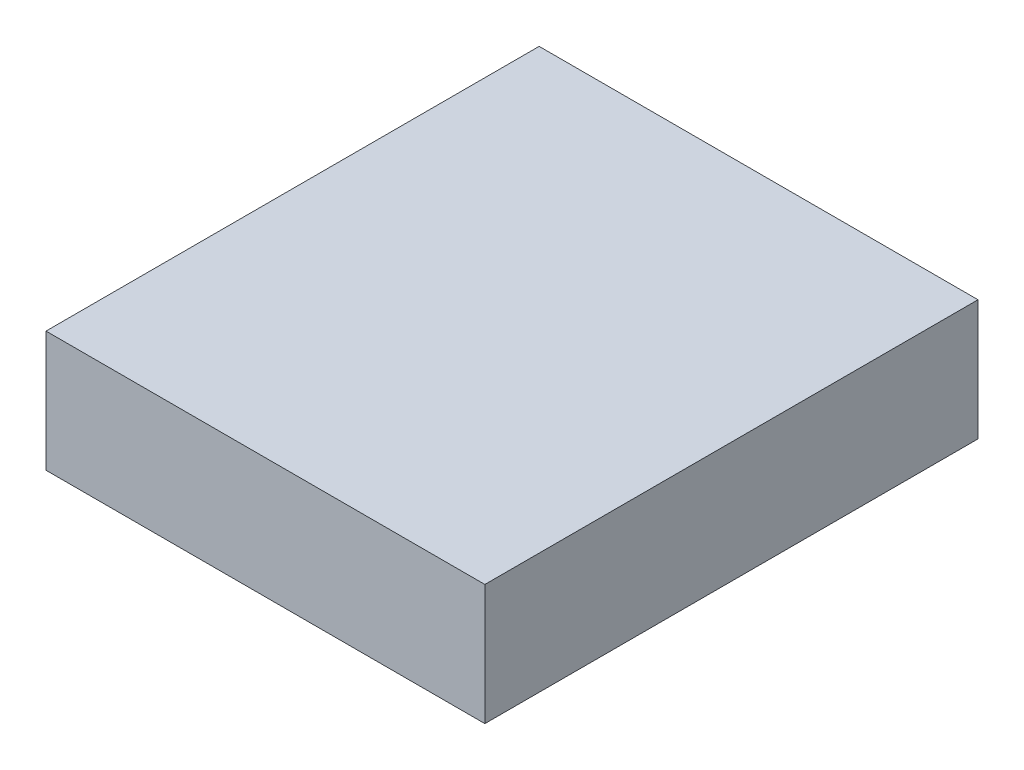
ISO-10303-21;
HEADER;
FILE_DESCRIPTION(('STEP AP214'),'2;1');
FILE_NAME('part.step','',(''),(''),'','','');
FILE_SCHEMA(('AUTOMOTIVE_DESIGN { 1 0 10303 214 1 1 1 1 }'));
ENDSEC;
DATA;
#1=APPLICATION_CONTEXT('core data for automotive mechanical design processes');
#2=APPLICATION_PROTOCOL_DEFINITION('international standard','automotive_design',2000,#1);
#3=PRODUCT_CONTEXT('',#1,'mechanical');
#4=PRODUCT('Part','Part','',(#3));
#5=PRODUCT_RELATED_PRODUCT_CATEGORY('part','',(#4));
#6=PRODUCT_DEFINITION_FORMATION('','',#4);
#7=PRODUCT_DEFINITION_CONTEXT('part definition',#1,'design');
#8=PRODUCT_DEFINITION('design','',#6,#7);
#9=PRODUCT_DEFINITION_SHAPE('','',#8);
#10=(LENGTH_UNIT() NAMED_UNIT(*) SI_UNIT(.MILLI.,.METRE.));
#11=(NAMED_UNIT(*) PLANE_ANGLE_UNIT() SI_UNIT($,.RADIAN.));
#12=(NAMED_UNIT(*) SI_UNIT($,.STERADIAN.) SOLID_ANGLE_UNIT());
#13=UNCERTAINTY_MEASURE_WITH_UNIT(LENGTH_MEASURE(1.E-05),#10,'distance_accuracy_value','');
#14=(GEOMETRIC_REPRESENTATION_CONTEXT(3) GLOBAL_UNCERTAINTY_ASSIGNED_CONTEXT((#13)) GLOBAL_UNIT_ASSIGNED_CONTEXT((#10,
#11,#12)) REPRESENTATION_CONTEXT('',''));
#15=CARTESIAN_POINT('',(0.,0.,0.));
#16=DIRECTION('',(0.,0.,1.));
#17=DIRECTION('',(1.,0.,0.));
#18=AXIS2_PLACEMENT_3D('',#15,#16,#17);
#19=CARTESIAN_POINT('',(-42.05,11.55,-47.25));
#20=DIRECTION('',(1.,0.,0.));
#21=DIRECTION('',(0.,0.,-1.));
#22=AXIS2_PLACEMENT_3D('',#19,#20,#21);
#23=PLANE('',#22);
#24=DIRECTION('',(0.,0.,1.));
#25=VECTOR('',#24,1.);
#26=CARTESIAN_POINT('',(-42.05,-11.55,-47.25));
#27=LINE('',#26,#25);
#28=CARTESIAN_POINT('',(-42.05,-11.55,-47.25));
#29=VERTEX_POINT('',#28);
#30=CARTESIAN_POINT('',(-42.05,-11.55,47.25));
#31=VERTEX_POINT('',#30);
#32=EDGE_CURVE('E117',#29,#31,#27,.T.);
#33=ORIENTED_EDGE('',*,*,#32,.T.);
#34=DIRECTION('',(0.,-1.,0.));
#35=VECTOR('',#34,1.);
#36=CARTESIAN_POINT('',(-42.05,11.55,47.25));
#37=LINE('',#36,#35);
#38=CARTESIAN_POINT('',(-42.05,11.55,47.25));
#39=VERTEX_POINT('',#38);
#40=EDGE_CURVE('E11',#39,#31,#37,.T.);
#41=ORIENTED_EDGE('',*,*,#40,.F.);
#42=DIRECTION('',(0.,0.,1.));
#43=VECTOR('',#42,1.);
#44=CARTESIAN_POINT('',(-42.05,11.55,-47.25));
#45=LINE('',#44,#43);
#46=CARTESIAN_POINT('',(-42.05,11.55,-47.25));
#47=VERTEX_POINT('',#46);
#48=EDGE_CURVE('E101',#47,#39,#45,.T.);
#49=ORIENTED_EDGE('',*,*,#48,.F.);
#50=DIRECTION('',(0.,-1.,0.));
#51=VECTOR('',#50,1.);
#52=CARTESIAN_POINT('',(-42.05,11.55,-47.25));
#53=LINE('',#52,#51);
#54=EDGE_CURVE('E113',#47,#29,#53,.T.);
#55=ORIENTED_EDGE('',*,*,#54,.T.);
#56=EDGE_LOOP('',(#33,#41,#49,#55));
#57=FACE_BOUND('',#56,.T.);
#58=ADVANCED_FACE('F49',(#57),#23,.F.);
#59=CARTESIAN_POINT('',(-42.05,11.55,47.25));
#60=DIRECTION('',(0.,0.,-1.));
#61=DIRECTION('',(-1.,0.,0.));
#62=AXIS2_PLACEMENT_3D('',#59,#60,#61);
#63=PLANE('',#62);
#64=DIRECTION('',(1.,0.,0.));
#65=VECTOR('',#64,1.);
#66=CARTESIAN_POINT('',(-42.05,-11.55,47.25));
#67=LINE('',#66,#65);
#68=CARTESIAN_POINT('',(42.05,-11.55,47.25));
#69=VERTEX_POINT('',#68);
#70=EDGE_CURVE('E106',#31,#69,#67,.T.);
#71=ORIENTED_EDGE('',*,*,#70,.T.);
#72=DIRECTION('',(0.,-1.,0.));
#73=VECTOR('',#72,1.);
#74=CARTESIAN_POINT('',(42.05,11.55,47.25));
#75=LINE('',#74,#73);
#76=CARTESIAN_POINT('',(42.05,11.55,47.25));
#77=VERTEX_POINT('',#76);
#78=EDGE_CURVE('E58',#77,#69,#75,.T.);
#79=ORIENTED_EDGE('',*,*,#78,.F.);
#80=DIRECTION('',(1.,0.,0.));
#81=VECTOR('',#80,1.);
#82=CARTESIAN_POINT('',(-42.05,11.55,47.25));
#83=LINE('',#82,#81);
#84=EDGE_CURVE('E96',#39,#77,#83,.T.);
#85=ORIENTED_EDGE('',*,*,#84,.F.);
#86=ORIENTED_EDGE('',*,*,#40,.T.);
#87=EDGE_LOOP('',(#71,#79,#85,#86));
#88=FACE_BOUND('',#87,.T.);
#89=ADVANCED_FACE('F105',(#88),#63,.F.);
#90=CARTESIAN_POINT('',(42.05,11.55,-47.25));
#91=DIRECTION('',(-1.,0.,0.));
#92=DIRECTION('',(0.,0.,1.));
#93=AXIS2_PLACEMENT_3D('',#90,#91,#92);
#94=PLANE('',#93);
#95=DIRECTION('',(0.,0.,-1.));
#96=VECTOR('',#95,1.);
#97=CARTESIAN_POINT('',(42.05,-11.55,-47.25));
#98=LINE('',#97,#96);
#99=CARTESIAN_POINT('',(42.05,-11.55,-47.25));
#100=VERTEX_POINT('',#99);
#101=EDGE_CURVE('E83',#69,#100,#98,.T.);
#102=ORIENTED_EDGE('',*,*,#101,.T.);
#103=DIRECTION('',(0.,-1.,0.));
#104=VECTOR('',#103,1.);
#105=CARTESIAN_POINT('',(42.05,11.55,-47.25));
#106=LINE('',#105,#104);
#107=CARTESIAN_POINT('',(42.05,11.55,-47.25));
#108=VERTEX_POINT('',#107);
#109=EDGE_CURVE('E108',#108,#100,#106,.T.);
#110=ORIENTED_EDGE('',*,*,#109,.F.);
#111=DIRECTION('',(0.,0.,-1.));
#112=VECTOR('',#111,1.);
#113=CARTESIAN_POINT('',(42.05,11.55,-47.25));
#114=LINE('',#113,#112);
#115=EDGE_CURVE('E99',#77,#108,#114,.T.);
#116=ORIENTED_EDGE('',*,*,#115,.F.);
#117=ORIENTED_EDGE('',*,*,#78,.T.);
#118=EDGE_LOOP('',(#102,#110,#116,#117));
#119=FACE_BOUND('',#118,.T.);
#120=ADVANCED_FACE('F109',(#119),#94,.F.);
#121=CARTESIAN_POINT('',(-42.05,11.55,-47.25));
#122=DIRECTION('',(0.,0.,1.));
#123=DIRECTION('',(1.,0.,0.));
#124=AXIS2_PLACEMENT_3D('',#121,#122,#123);
#125=PLANE('',#124);
#126=DIRECTION('',(-1.,0.,0.));
#127=VECTOR('',#126,1.);
#128=CARTESIAN_POINT('',(-42.05,-11.55,-47.25));
#129=LINE('',#128,#127);
#130=EDGE_CURVE('E89',#100,#29,#129,.T.);
#131=ORIENTED_EDGE('',*,*,#130,.T.);
#132=ORIENTED_EDGE('',*,*,#54,.F.);
#133=DIRECTION('',(-1.,0.,0.));
#134=VECTOR('',#133,1.);
#135=CARTESIAN_POINT('',(-42.05,11.55,-47.25));
#136=LINE('',#135,#134);
#137=EDGE_CURVE('E66',#108,#47,#136,.T.);
#138=ORIENTED_EDGE('',*,*,#137,.F.);
#139=ORIENTED_EDGE('',*,*,#109,.T.);
#140=EDGE_LOOP('',(#131,#132,#138,#139));
#141=FACE_BOUND('',#140,.T.);
#142=ADVANCED_FACE('F130',(#141),#125,.F.);
#143=CARTESIAN_POINT('',(0.,11.55,0.));
#144=DIRECTION('',(0.,1.,0.));
#145=DIRECTION('',(0.,0.,1.));
#146=AXIS2_PLACEMENT_3D('',#143,#144,#145);
#147=PLANE('',#146);
#148=ORIENTED_EDGE('',*,*,#48,.T.);
#149=ORIENTED_EDGE('',*,*,#84,.T.);
#150=ORIENTED_EDGE('',*,*,#115,.T.);
#151=ORIENTED_EDGE('',*,*,#137,.T.);
#152=EDGE_LOOP('',(#148,#149,#150,#151));
#153=FACE_BOUND('',#152,.T.);
#154=ADVANCED_FACE('F97',(#153),#147,.T.);
#155=CARTESIAN_POINT('',(0.,-11.55,0.));
#156=DIRECTION('',(0.,1.,0.));
#157=DIRECTION('',(0.,0.,1.));
#158=AXIS2_PLACEMENT_3D('',#155,#156,#157);
#159=PLANE('',#158);
#160=ORIENTED_EDGE('',*,*,#32,.F.);
#161=ORIENTED_EDGE('',*,*,#130,.F.);
#162=ORIENTED_EDGE('',*,*,#101,.F.);
#163=ORIENTED_EDGE('',*,*,#70,.F.);
#164=EDGE_LOOP('',(#160,#161,#162,#163));
#165=FACE_BOUND('',#164,.T.);
#166=ADVANCED_FACE('F133',(#165),#159,.F.);
#167=CLOSED_SHELL('',(#58,#89,#120,#142,#154,#166));
#168=MANIFOLD_SOLID_BREP('B2',#167);
#169=ADVANCED_BREP_SHAPE_REPRESENTATION('',(#18,#168),#14);
#170=SHAPE_DEFINITION_REPRESENTATION(#9,#169);
ENDSEC;
END-ISO-10303-21;
